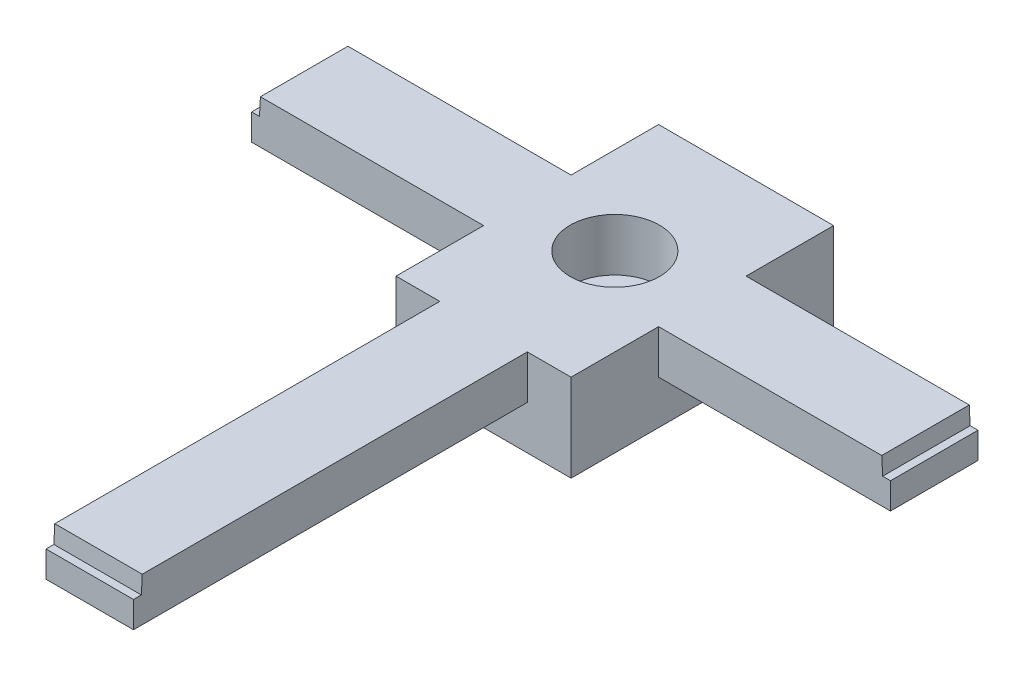
ISO-10303-21;
HEADER;
FILE_DESCRIPTION(('STEP AP214'),'2;1');
FILE_NAME('part.step','',(''),(''),'','','');
FILE_SCHEMA(('AUTOMOTIVE_DESIGN { 1 0 10303 214 1 1 1 1 }'));
ENDSEC;
DATA;
#1=APPLICATION_CONTEXT('core data for automotive mechanical design processes');
#2=APPLICATION_PROTOCOL_DEFINITION('international standard','automotive_design',2000,#1);
#3=PRODUCT_CONTEXT('',#1,'mechanical');
#4=PRODUCT('Part','Part','',(#3));
#5=PRODUCT_RELATED_PRODUCT_CATEGORY('part','',(#4));
#6=PRODUCT_DEFINITION_FORMATION('','',#4);
#7=PRODUCT_DEFINITION_CONTEXT('part definition',#1,'design');
#8=PRODUCT_DEFINITION('design','',#6,#7);
#9=PRODUCT_DEFINITION_SHAPE('','',#8);
#10=(LENGTH_UNIT() NAMED_UNIT(*) SI_UNIT(.MILLI.,.METRE.));
#11=(NAMED_UNIT(*) PLANE_ANGLE_UNIT() SI_UNIT($,.RADIAN.));
#12=(NAMED_UNIT(*) SI_UNIT($,.STERADIAN.) SOLID_ANGLE_UNIT());
#13=UNCERTAINTY_MEASURE_WITH_UNIT(LENGTH_MEASURE(1.E-05),#10,'distance_accuracy_value','');
#14=(GEOMETRIC_REPRESENTATION_CONTEXT(3) GLOBAL_UNCERTAINTY_ASSIGNED_CONTEXT((#13)) GLOBAL_UNIT_ASSIGNED_CONTEXT((#10,
#11,#12)) REPRESENTATION_CONTEXT('',''));
#15=CARTESIAN_POINT('',(0.,0.,0.));
#16=DIRECTION('',(0.,0.,1.));
#17=DIRECTION('',(1.,0.,0.));
#18=AXIS2_PLACEMENT_3D('',#15,#16,#17);
#19=CARTESIAN_POINT('',(0.,5.,0.));
#20=DIRECTION('',(0.,0.,1.));
#21=DIRECTION('',(1.,0.,0.));
#22=AXIS2_PLACEMENT_3D('',#19,#20,#21);
#23=PLANE('',#22);
#24=DIRECTION('',(-1.,0.,0.));
#25=VECTOR('',#24,1.);
#26=CARTESIAN_POINT('',(0.,0.,0.));
#27=LINE('',#26,#25);
#28=CARTESIAN_POINT('',(0.,0.,0.));
#29=VERTEX_POINT('',#28);
#30=CARTESIAN_POINT('',(-26.5,0.,0.));
#31=VERTEX_POINT('',#30);
#32=EDGE_CURVE('E310',#29,#31,#27,.T.);
#33=ORIENTED_EDGE('',*,*,#32,.T.);
#34=DIRECTION('',(0.,1.,0.));
#35=VECTOR('',#34,1.);
#36=CARTESIAN_POINT('',(-26.5,5.,0.));
#37=LINE('',#36,#35);
#38=CARTESIAN_POINT('',(-26.5,5.,0.));
#39=VERTEX_POINT('',#38);
#40=EDGE_CURVE('E62',#31,#39,#37,.T.);
#41=ORIENTED_EDGE('',*,*,#40,.T.);
#42=DIRECTION('',(-1.,0.,0.));
#43=VECTOR('',#42,1.);
#44=CARTESIAN_POINT('',(0.,5.,0.));
#45=LINE('',#44,#43);
#46=CARTESIAN_POINT('',(-1.,5.,0.));
#47=VERTEX_POINT('',#46);
#48=EDGE_CURVE('E295',#47,#39,#45,.T.);
#49=ORIENTED_EDGE('',*,*,#48,.F.);
#50=DIRECTION('',(0.0523359562429438,-0.998629534754574,0.));
#51=VECTOR('',#50,1.);
#52=CARTESIAN_POINT('',(-0.997260947684137,4.94773576836617,0.));
#53=LINE('',#52,#51);
#54=CARTESIAN_POINT('',(-0.895184441433918,3.,0.));
#55=VERTEX_POINT('',#54);
#56=EDGE_CURVE('E263',#47,#55,#53,.T.);
#57=ORIENTED_EDGE('',*,*,#56,.T.);
#58=DIRECTION('',(-1.,0.,0.));
#59=VECTOR('',#58,1.);
#60=CARTESIAN_POINT('',(0.,3.,0.));
#61=LINE('',#60,#59);
#62=CARTESIAN_POINT('',(0.,3.,0.));
#63=VERTEX_POINT('',#62);
#64=EDGE_CURVE('E261',#63,#55,#61,.T.);
#65=ORIENTED_EDGE('',*,*,#64,.F.);
#66=DIRECTION('',(0.,-1.,0.));
#67=VECTOR('',#66,1.);
#68=CARTESIAN_POINT('',(0.,5.,0.));
#69=LINE('',#68,#67);
#70=EDGE_CURVE('E291',#63,#29,#69,.T.);
#71=ORIENTED_EDGE('',*,*,#70,.T.);
#72=EDGE_LOOP('',(#33,#41,#49,#57,#65,#71));
#73=FACE_BOUND('',#72,.T.);
#74=ADVANCED_FACE('F38',(#73),#23,.F.);
#75=CARTESIAN_POINT('',(0.,0.,0.));
#76=DIRECTION('',(0.,-1.,0.));
#77=DIRECTION('',(0.,0.,-1.));
#78=AXIS2_PLACEMENT_3D('',#75,#76,#77);
#79=PLANE('',#78);
#80=DIRECTION('',(0.,0.,1.));
#81=VECTOR('',#80,1.);
#82=CARTESIAN_POINT('',(-26.5,0.,0.));
#83=LINE('',#82,#81);
#84=CARTESIAN_POINT('',(-26.5,0.,10.));
#85=VERTEX_POINT('',#84);
#86=EDGE_CURVE('E12',#31,#85,#83,.T.);
#87=ORIENTED_EDGE('',*,*,#86,.F.);
#88=ORIENTED_EDGE('',*,*,#32,.F.);
#89=DIRECTION('',(0.,0.,-1.));
#90=VECTOR('',#89,1.);
#91=CARTESIAN_POINT('',(0.,0.,0.));
#92=LINE('',#91,#90);
#93=CARTESIAN_POINT('',(0.,0.,10.));
#94=VERTEX_POINT('',#93);
#95=EDGE_CURVE('E312',#94,#29,#92,.T.);
#96=ORIENTED_EDGE('',*,*,#95,.F.);
#97=DIRECTION('',(1.,0.,0.));
#98=VECTOR('',#97,1.);
#99=CARTESIAN_POINT('',(0.,0.,10.));
#100=LINE('',#99,#98);
#101=EDGE_CURVE('E292',#85,#94,#100,.T.);
#102=ORIENTED_EDGE('',*,*,#101,.F.);
#103=EDGE_LOOP('',(#87,#88,#96,#102));
#104=FACE_BOUND('',#103,.T.);
#105=ADVANCED_FACE('F408',(#104),#79,.T.);
#106=DIRECTION('',(-1.,0.,0.));
#107=VECTOR('',#106,1.);
#108=CARTESIAN_POINT('',(0.,0.,20.));
#109=LINE('',#108,#107);
#110=CARTESIAN_POINT('',(-31.5,0.,20.));
#111=VERTEX_POINT('',#110);
#112=CARTESIAN_POINT('',(-41.5,0.,20.));
#113=VERTEX_POINT('',#112);
#114=EDGE_CURVE('E47',#111,#113,#109,.T.);
#115=ORIENTED_EDGE('',*,*,#114,.F.);
#116=DIRECTION('',(0.,0.,-1.));
#117=VECTOR('',#116,1.);
#118=CARTESIAN_POINT('',(-31.5,0.,10.));
#119=LINE('',#118,#117);
#120=CARTESIAN_POINT('',(-31.5,0.,65.0000000000001));
#121=VERTEX_POINT('',#120);
#122=EDGE_CURVE('E294',#121,#111,#119,.T.);
#123=ORIENTED_EDGE('',*,*,#122,.F.);
#124=DIRECTION('',(1.,0.,0.));
#125=VECTOR('',#124,1.);
#126=CARTESIAN_POINT('',(-41.5,0.,65.0000000000001));
#127=LINE('',#126,#125);
#128=CARTESIAN_POINT('',(-41.5,0.,65.0000000000001));
#129=VERTEX_POINT('',#128);
#130=EDGE_CURVE('E298',#129,#121,#127,.T.);
#131=ORIENTED_EDGE('',*,*,#130,.F.);
#132=DIRECTION('',(0.,0.,1.));
#133=VECTOR('',#132,1.);
#134=CARTESIAN_POINT('',(-41.5,0.,10.));
#135=LINE('',#134,#133);
#136=EDGE_CURVE('E301',#113,#129,#135,.T.);
#137=ORIENTED_EDGE('',*,*,#136,.F.);
#138=EDGE_LOOP('',(#115,#123,#131,#137));
#139=FACE_BOUND('',#138,.T.);
#140=ADVANCED_FACE('F368',(#139),#79,.T.);
#141=CARTESIAN_POINT('',(0.,5.,0.));
#142=DIRECTION('',(-1.,0.,0.));
#143=DIRECTION('',(0.,0.,1.));
#144=AXIS2_PLACEMENT_3D('',#141,#142,#143);
#145=PLANE('',#144);
#146=DIRECTION('',(0.,0.,-1.));
#147=VECTOR('',#146,1.);
#148=CARTESIAN_POINT('',(0.,3.,0.));
#149=LINE('',#148,#147);
#150=CARTESIAN_POINT('',(0.,3.,10.));
#151=VERTEX_POINT('',#150);
#152=EDGE_CURVE('E259',#151,#63,#149,.T.);
#153=ORIENTED_EDGE('',*,*,#152,.F.);
#154=DIRECTION('',(0.,-1.,0.));
#155=VECTOR('',#154,1.);
#156=CARTESIAN_POINT('',(0.,5.,10.));
#157=LINE('',#156,#155);
#158=EDGE_CURVE('E319',#151,#94,#157,.T.);
#159=ORIENTED_EDGE('',*,*,#158,.T.);
#160=ORIENTED_EDGE('',*,*,#95,.T.);
#161=ORIENTED_EDGE('',*,*,#70,.F.);
#162=EDGE_LOOP('',(#153,#159,#160,#161));
#163=FACE_BOUND('',#162,.T.);
#164=ADVANCED_FACE('F404',(#163),#145,.F.);
#165=CARTESIAN_POINT('',(-73.,5.,0.));
#166=DIRECTION('',(1.,0.,0.));
#167=DIRECTION('',(0.,0.,-1.));
#168=AXIS2_PLACEMENT_3D('',#165,#166,#167);
#169=PLANE('',#168);
#170=DIRECTION('',(0.,0.,1.));
#171=VECTOR('',#170,1.);
#172=CARTESIAN_POINT('',(-73.,3.,0.));
#173=LINE('',#172,#171);
#174=CARTESIAN_POINT('',(-73.,3.,0.));
#175=VERTEX_POINT('',#174);
#176=CARTESIAN_POINT('',(-73.,3.,10.));
#177=VERTEX_POINT('',#176);
#178=EDGE_CURVE('E272',#175,#177,#173,.T.);
#179=ORIENTED_EDGE('',*,*,#178,.F.);
#180=DIRECTION('',(0.,-1.,0.));
#181=VECTOR('',#180,1.);
#182=CARTESIAN_POINT('',(-73.,5.,0.));
#183=LINE('',#182,#181);
#184=CARTESIAN_POINT('',(-73.,0.,0.));
#185=VERTEX_POINT('',#184);
#186=EDGE_CURVE('E335',#175,#185,#183,.T.);
#187=ORIENTED_EDGE('',*,*,#186,.T.);
#188=DIRECTION('',(0.,0.,1.));
#189=VECTOR('',#188,1.);
#190=CARTESIAN_POINT('',(-73.,0.,0.));
#191=LINE('',#190,#189);
#192=CARTESIAN_POINT('',(-73.,0.,10.));
#193=VERTEX_POINT('',#192);
#194=EDGE_CURVE('E306',#185,#193,#191,.T.);
#195=ORIENTED_EDGE('',*,*,#194,.T.);
#196=DIRECTION('',(0.,-1.,0.));
#197=VECTOR('',#196,1.);
#198=CARTESIAN_POINT('',(-73.,5.,10.));
#199=LINE('',#198,#197);
#200=EDGE_CURVE('E332',#177,#193,#199,.T.);
#201=ORIENTED_EDGE('',*,*,#200,.F.);
#202=EDGE_LOOP('',(#179,#187,#195,#201));
#203=FACE_BOUND('',#202,.T.);
#204=ADVANCED_FACE('F454',(#203),#169,.F.);
#205=CARTESIAN_POINT('',(-41.5,5.,65.0000000000001));
#206=DIRECTION('',(0.,0.,-1.));
#207=DIRECTION('',(-1.,0.,0.));
#208=AXIS2_PLACEMENT_3D('',#205,#206,#207);
#209=PLANE('',#208);
#210=DIRECTION('',(1.,0.,0.));
#211=VECTOR('',#210,1.);
#212=CARTESIAN_POINT('',(-41.5,3.,65.0000000000001));
#213=LINE('',#212,#211);
#214=CARTESIAN_POINT('',(-41.5,3.,65.0000000000001));
#215=VERTEX_POINT('',#214);
#216=CARTESIAN_POINT('',(-31.5,3.,65.0000000000001));
#217=VERTEX_POINT('',#216);
#218=EDGE_CURVE('E284',#215,#217,#213,.T.);
#219=ORIENTED_EDGE('',*,*,#218,.F.);
#220=DIRECTION('',(0.,-1.,0.));
#221=VECTOR('',#220,1.);
#222=CARTESIAN_POINT('',(-41.5,5.,65.0000000000001));
#223=LINE('',#222,#221);
#224=EDGE_CURVE('E328',#215,#129,#223,.T.);
#225=ORIENTED_EDGE('',*,*,#224,.T.);
#226=ORIENTED_EDGE('',*,*,#130,.T.);
#227=DIRECTION('',(0.,-1.,0.));
#228=VECTOR('',#227,1.);
#229=CARTESIAN_POINT('',(-31.5,5.,65.0000000000001));
#230=LINE('',#229,#228);
#231=EDGE_CURVE('E331',#217,#121,#230,.T.);
#232=ORIENTED_EDGE('',*,*,#231,.F.);
#233=EDGE_LOOP('',(#219,#225,#226,#232));
#234=FACE_BOUND('',#233,.T.);
#235=ADVANCED_FACE('F377',(#234),#209,.F.);
#236=CARTESIAN_POINT('',(0.,5.,0.));
#237=DIRECTION('',(0.,1.,0.));
#238=DIRECTION('',(0.,0.,1.));
#239=AXIS2_PLACEMENT_3D('',#236,#237,#238);
#240=PLANE('',#239);
#241=CARTESIAN_POINT('',(-36.5,5.,5.00000000000002));
#242=DIRECTION('',(0.,1.,0.));
#243=DIRECTION('',(0.,0.,1.));
#244=AXIS2_PLACEMENT_3D('',#241,#242,#243);
#245=CIRCLE('',#244,5.1);
#246=CARTESIAN_POINT('',(-36.5,5.,10.1));
#247=VERTEX_POINT('',#246);
#248=EDGE_CURVE('E224',#247,#247,#245,.T.);
#249=ORIENTED_EDGE('',*,*,#248,.F.);
#250=EDGE_LOOP('',(#249));
#251=FACE_BOUND('',#250,.T.);
#252=DIRECTION('',(1.,0.,0.));
#253=VECTOR('',#252,1.);
#254=CARTESIAN_POINT('',(-41.5,5.,10.));
#255=LINE('',#254,#253);
#256=CARTESIAN_POINT('',(-72.,5.,10.));
#257=VERTEX_POINT('',#256);
#258=CARTESIAN_POINT('',(-46.5,5.,10.));
#259=VERTEX_POINT('',#258);
#260=EDGE_CURVE('E324',#257,#259,#255,.T.);
#261=ORIENTED_EDGE('',*,*,#260,.T.);
#262=DIRECTION('',(0.,0.,1.));
#263=VECTOR('',#262,1.);
#264=CARTESIAN_POINT('',(-46.5,5.,-9.99999999999999));
#265=LINE('',#264,#263);
#266=CARTESIAN_POINT('',(-46.5,5.,20.));
#267=VERTEX_POINT('',#266);
#268=EDGE_CURVE('E234',#259,#267,#265,.T.);
#269=ORIENTED_EDGE('',*,*,#268,.T.);
#270=DIRECTION('',(1.,0.,0.));
#271=VECTOR('',#270,1.);
#272=CARTESIAN_POINT('',(-26.5,5.,20.));
#273=LINE('',#272,#271);
#274=CARTESIAN_POINT('',(-41.5,5.,20.));
#275=VERTEX_POINT('',#274);
#276=EDGE_CURVE('E218',#267,#275,#273,.T.);
#277=ORIENTED_EDGE('',*,*,#276,.T.);
#278=DIRECTION('',(0.,0.,1.));
#279=VECTOR('',#278,1.);
#280=CARTESIAN_POINT('',(-41.5,5.,10.));
#281=LINE('',#280,#279);
#282=CARTESIAN_POINT('',(-41.5,5.,64.0000000000001));
#283=VERTEX_POINT('',#282);
#284=EDGE_CURVE('E322',#275,#283,#281,.T.);
#285=ORIENTED_EDGE('',*,*,#284,.T.);
#286=DIRECTION('',(-1.,0.,0.));
#287=VECTOR('',#286,1.);
#288=CARTESIAN_POINT('',(0.,5.,64.0000000000001));
#289=LINE('',#288,#287);
#290=CARTESIAN_POINT('',(-31.5,5.,64.0000000000001));
#291=VERTEX_POINT('',#290);
#292=EDGE_CURVE('E278',#291,#283,#289,.T.);
#293=ORIENTED_EDGE('',*,*,#292,.F.);
#294=DIRECTION('',(0.,0.,-1.));
#295=VECTOR('',#294,1.);
#296=CARTESIAN_POINT('',(-31.5,5.,10.));
#297=LINE('',#296,#295);
#298=CARTESIAN_POINT('',(-31.5,5.,20.));
#299=VERTEX_POINT('',#298);
#300=EDGE_CURVE('E318',#291,#299,#297,.T.);
#301=ORIENTED_EDGE('',*,*,#300,.T.);
#302=CARTESIAN_POINT('',(-26.5,5.,20.));
#303=VERTEX_POINT('',#302);
#304=EDGE_CURVE('E221',#299,#303,#273,.T.);
#305=ORIENTED_EDGE('',*,*,#304,.T.);
#306=DIRECTION('',(0.,0.,-1.));
#307=VECTOR('',#306,1.);
#308=CARTESIAN_POINT('',(-26.5,5.,-9.99999999999999));
#309=LINE('',#308,#307);
#310=CARTESIAN_POINT('',(-26.5,5.,10.));
#311=VERTEX_POINT('',#310);
#312=EDGE_CURVE('E229',#303,#311,#309,.T.);
#313=ORIENTED_EDGE('',*,*,#312,.T.);
#314=DIRECTION('',(1.,0.,0.));
#315=VECTOR('',#314,1.);
#316=CARTESIAN_POINT('',(0.,5.,10.));
#317=LINE('',#316,#315);
#318=CARTESIAN_POINT('',(-0.999999999999999,5.,10.));
#319=VERTEX_POINT('',#318);
#320=EDGE_CURVE('E316',#311,#319,#317,.T.);
#321=ORIENTED_EDGE('',*,*,#320,.T.);
#322=DIRECTION('',(0.,0.,1.));
#323=VECTOR('',#322,1.);
#324=CARTESIAN_POINT('',(-1.,5.,0.));
#325=LINE('',#324,#323);
#326=EDGE_CURVE('E254',#47,#319,#325,.T.);
#327=ORIENTED_EDGE('',*,*,#326,.F.);
#328=ORIENTED_EDGE('',*,*,#48,.T.);
#329=CARTESIAN_POINT('',(-26.5,5.,-9.99999999999999));
#330=VERTEX_POINT('',#329);
#331=EDGE_CURVE('E232',#39,#330,#309,.T.);
#332=ORIENTED_EDGE('',*,*,#331,.T.);
#333=DIRECTION('',(-1.,0.,0.));
#334=VECTOR('',#333,1.);
#335=CARTESIAN_POINT('',(-26.5,5.,-9.99999999999999));
#336=LINE('',#335,#334);
#337=CARTESIAN_POINT('',(-46.5,5.,-9.99999999999999));
#338=VERTEX_POINT('',#337);
#339=EDGE_CURVE('E197',#330,#338,#336,.T.);
#340=ORIENTED_EDGE('',*,*,#339,.T.);
#341=CARTESIAN_POINT('',(-46.5,5.,0.));
#342=VERTEX_POINT('',#341);
#343=EDGE_CURVE('E235',#338,#342,#265,.T.);
#344=ORIENTED_EDGE('',*,*,#343,.T.);
#345=CARTESIAN_POINT('',(-72.,5.,0.));
#346=VERTEX_POINT('',#345);
#347=EDGE_CURVE('E54',#342,#346,#45,.T.);
#348=ORIENTED_EDGE('',*,*,#347,.T.);
#349=DIRECTION('',(0.,0.,-1.));
#350=VECTOR('',#349,1.);
#351=CARTESIAN_POINT('',(-72.,5.,0.));
#352=LINE('',#351,#350);
#353=EDGE_CURVE('E266',#257,#346,#352,.T.);
#354=ORIENTED_EDGE('',*,*,#353,.F.);
#355=EDGE_LOOP('',(#261,#269,#277,#285,#293,#301,#305,#313,#321,#327,#328,#332,#340,#344,#348,#354));
#356=FACE_BOUND('',#355,.T.);
#357=ADVANCED_FACE('F384',(#251,#356),#240,.T.);
#358=ORIENTED_EDGE('',*,*,#347,.F.);
#359=DIRECTION('',(0.,-1.,0.));
#360=VECTOR('',#359,1.);
#361=CARTESIAN_POINT('',(-46.5,5.,0.));
#362=LINE('',#361,#360);
#363=CARTESIAN_POINT('',(-46.5,0.,0.));
#364=VERTEX_POINT('',#363);
#365=EDGE_CURVE('E245',#342,#364,#362,.T.);
#366=ORIENTED_EDGE('',*,*,#365,.T.);
#367=EDGE_CURVE('E309',#364,#185,#27,.T.);
#368=ORIENTED_EDGE('',*,*,#367,.T.);
#369=ORIENTED_EDGE('',*,*,#186,.F.);
#370=DIRECTION('',(-1.,0.,0.));
#371=VECTOR('',#370,1.);
#372=CARTESIAN_POINT('',(0.,3.,0.));
#373=LINE('',#372,#371);
#374=CARTESIAN_POINT('',(-72.1048155585661,3.,0.));
#375=VERTEX_POINT('',#374);
#376=EDGE_CURVE('E274',#375,#175,#373,.T.);
#377=ORIENTED_EDGE('',*,*,#376,.F.);
#378=DIRECTION('',(0.0523359562429438,0.998629534754574,0.));
#379=VECTOR('',#378,1.);
#380=CARTESIAN_POINT('',(-71.8027882332578,8.76302467763552,0.));
#381=LINE('',#380,#379);
#382=EDGE_CURVE('E276',#375,#346,#381,.T.);
#383=ORIENTED_EDGE('',*,*,#382,.T.);
#384=EDGE_LOOP('',(#358,#366,#368,#369,#377,#383));
#385=FACE_BOUND('',#384,.T.);
#386=ADVANCED_FACE('F40',(#385),#23,.F.);
#387=CARTESIAN_POINT('',(-41.5,5.,10.));
#388=DIRECTION('',(0.,0.,-1.));
#389=DIRECTION('',(-1.,0.,0.));
#390=AXIS2_PLACEMENT_3D('',#387,#388,#389);
#391=PLANE('',#390);
#392=DIRECTION('',(1.,0.,0.));
#393=VECTOR('',#392,1.);
#394=CARTESIAN_POINT('',(-41.5,0.,10.));
#395=LINE('',#394,#393);
#396=CARTESIAN_POINT('',(-46.5,0.,10.));
#397=VERTEX_POINT('',#396);
#398=EDGE_CURVE('E303',#193,#397,#395,.T.);
#399=ORIENTED_EDGE('',*,*,#398,.T.);
#400=DIRECTION('',(0.,1.,0.));
#401=VECTOR('',#400,1.);
#402=CARTESIAN_POINT('',(-46.5,5.,10.));
#403=LINE('',#402,#401);
#404=EDGE_CURVE('E239',#397,#259,#403,.T.);
#405=ORIENTED_EDGE('',*,*,#404,.T.);
#406=ORIENTED_EDGE('',*,*,#260,.F.);
#407=DIRECTION('',(-0.0523359562429438,-0.998629534754574,0.));
#408=VECTOR('',#407,1.);
#409=CARTESIAN_POINT('',(-71.9164589043662,6.59405906483171,10.));
#410=LINE('',#409,#408);
#411=CARTESIAN_POINT('',(-72.1048155585661,3.,10.));
#412=VERTEX_POINT('',#411);
#413=EDGE_CURVE('E347',#257,#412,#410,.T.);
#414=ORIENTED_EDGE('',*,*,#413,.T.);
#415=DIRECTION('',(1.,0.,0.));
#416=VECTOR('',#415,1.);
#417=CARTESIAN_POINT('',(-41.5,3.,10.));
#418=LINE('',#417,#416);
#419=EDGE_CURVE('E345',#177,#412,#418,.T.);
#420=ORIENTED_EDGE('',*,*,#419,.F.);
#421=ORIENTED_EDGE('',*,*,#200,.T.);
#422=EDGE_LOOP('',(#399,#405,#406,#414,#420,#421));
#423=FACE_BOUND('',#422,.T.);
#424=ADVANCED_FACE('F444',(#423),#391,.F.);
#425=CARTESIAN_POINT('',(-41.5,5.,10.));
#426=DIRECTION('',(1.,0.,0.));
#427=DIRECTION('',(0.,0.,-1.));
#428=AXIS2_PLACEMENT_3D('',#425,#426,#427);
#429=PLANE('',#428);
#430=ORIENTED_EDGE('',*,*,#284,.F.);
#431=DIRECTION('',(0.,-1.,0.));
#432=VECTOR('',#431,1.);
#433=CARTESIAN_POINT('',(-41.5,5.,20.));
#434=LINE('',#433,#432);
#435=EDGE_CURVE('E249',#275,#113,#434,.T.);
#436=ORIENTED_EDGE('',*,*,#435,.T.);
#437=ORIENTED_EDGE('',*,*,#136,.T.);
#438=ORIENTED_EDGE('',*,*,#224,.F.);
#439=DIRECTION('',(0.,0.,1.));
#440=VECTOR('',#439,1.);
#441=CARTESIAN_POINT('',(-41.5,3.,10.));
#442=LINE('',#441,#440);
#443=CARTESIAN_POINT('',(-41.5,3.,64.1048155585661));
#444=VERTEX_POINT('',#443);
#445=EDGE_CURVE('E286',#444,#215,#442,.T.);
#446=ORIENTED_EDGE('',*,*,#445,.F.);
#447=DIRECTION('',(0.,0.998629534754574,-0.0523359562429438));
#448=VECTOR('',#447,1.);
#449=CARTESIAN_POINT('',(-41.5,7.82226850822664,63.8520911749434));
#450=LINE('',#449,#448);
#451=EDGE_CURVE('E288',#444,#283,#450,.T.);
#452=ORIENTED_EDGE('',*,*,#451,.T.);
#453=EDGE_LOOP('',(#430,#436,#437,#438,#446,#452));
#454=FACE_BOUND('',#453,.T.);
#455=ADVANCED_FACE('F381',(#454),#429,.F.);
#456=CARTESIAN_POINT('',(-31.5,5.,10.));
#457=DIRECTION('',(-1.,0.,0.));
#458=DIRECTION('',(0.,0.,1.));
#459=AXIS2_PLACEMENT_3D('',#456,#457,#458);
#460=PLANE('',#459);
#461=ORIENTED_EDGE('',*,*,#122,.T.);
#462=DIRECTION('',(0.,1.,0.));
#463=VECTOR('',#462,1.);
#464=CARTESIAN_POINT('',(-31.5,5.,20.));
#465=LINE('',#464,#463);
#466=EDGE_CURVE('E247',#111,#299,#465,.T.);
#467=ORIENTED_EDGE('',*,*,#466,.T.);
#468=ORIENTED_EDGE('',*,*,#300,.F.);
#469=DIRECTION('',(0.,-0.998629534754574,0.0523359562429438));
#470=VECTOR('',#469,1.);
#471=CARTESIAN_POINT('',(-31.5,7.82226850822664,63.8520911749434));
#472=LINE('',#471,#470);
#473=CARTESIAN_POINT('',(-31.5,3.,64.1048155585661));
#474=VERTEX_POINT('',#473);
#475=EDGE_CURVE('E342',#291,#474,#472,.T.);
#476=ORIENTED_EDGE('',*,*,#475,.T.);
#477=DIRECTION('',(0.,0.,-1.));
#478=VECTOR('',#477,1.);
#479=CARTESIAN_POINT('',(-31.5,3.,10.));
#480=LINE('',#479,#478);
#481=EDGE_CURVE('E315',#217,#474,#480,.T.);
#482=ORIENTED_EDGE('',*,*,#481,.F.);
#483=ORIENTED_EDGE('',*,*,#231,.T.);
#484=EDGE_LOOP('',(#461,#467,#468,#476,#482,#483));
#485=FACE_BOUND('',#484,.T.);
#486=ADVANCED_FACE('F371',(#485),#460,.F.);
#487=CARTESIAN_POINT('',(0.,5.,10.));
#488=DIRECTION('',(0.,0.,-1.));
#489=DIRECTION('',(-1.,0.,0.));
#490=AXIS2_PLACEMENT_3D('',#487,#488,#489);
#491=PLANE('',#490);
#492=ORIENTED_EDGE('',*,*,#320,.F.);
#493=DIRECTION('',(0.,-1.,0.));
#494=VECTOR('',#493,1.);
#495=CARTESIAN_POINT('',(-26.5,5.,10.));
#496=LINE('',#495,#494);
#497=EDGE_CURVE('E251',#311,#85,#496,.T.);
#498=ORIENTED_EDGE('',*,*,#497,.T.);
#499=ORIENTED_EDGE('',*,*,#101,.T.);
#500=ORIENTED_EDGE('',*,*,#158,.F.);
#501=DIRECTION('',(1.,0.,0.));
#502=VECTOR('',#501,1.);
#503=CARTESIAN_POINT('',(0.,3.,10.));
#504=LINE('',#503,#502);
#505=CARTESIAN_POINT('',(-0.895184441433918,3.,10.));
#506=VERTEX_POINT('',#505);
#507=EDGE_CURVE('E350',#506,#151,#504,.T.);
#508=ORIENTED_EDGE('',*,*,#507,.F.);
#509=DIRECTION('',(-0.0523359562429438,0.998629534754574,0.));
#510=VECTOR('',#509,1.);
#511=CARTESIAN_POINT('',(-0.997260947684135,4.94773576836617,10.));
#512=LINE('',#511,#510);
#513=EDGE_CURVE('E352',#506,#319,#512,.T.);
#514=ORIENTED_EDGE('',*,*,#513,.T.);
#515=EDGE_LOOP('',(#492,#498,#499,#500,#508,#514));
#516=FACE_BOUND('',#515,.T.);
#517=ADVANCED_FACE('F396',(#516),#491,.F.);
#518=DIRECTION('',(0.,0.,-1.));
#519=VECTOR('',#518,1.);
#520=CARTESIAN_POINT('',(-46.5,0.,0.));
#521=LINE('',#520,#519);
#522=EDGE_CURVE('E355',#397,#364,#521,.T.);
#523=ORIENTED_EDGE('',*,*,#522,.F.);
#524=ORIENTED_EDGE('',*,*,#398,.F.);
#525=ORIENTED_EDGE('',*,*,#194,.F.);
#526=ORIENTED_EDGE('',*,*,#367,.F.);
#527=EDGE_LOOP('',(#523,#524,#525,#526));
#528=FACE_BOUND('',#527,.T.);
#529=ADVANCED_FACE('F442',(#528),#79,.T.);
#530=CARTESIAN_POINT('',(0.,5.,64.0000000000001));
#531=DIRECTION('',(0.,-0.0523359562429438,-0.998629534754574));
#532=DIRECTION('',(0.,0.998629534754574,-0.0523359562429438));
#533=AXIS2_PLACEMENT_3D('',#530,#531,#532);
#534=PLANE('',#533);
#535=DIRECTION('',(-1.,0.,0.));
#536=VECTOR('',#535,1.);
#537=CARTESIAN_POINT('',(0.,3.,64.1048155585661));
#538=LINE('',#537,#536);
#539=EDGE_CURVE('E281',#474,#444,#538,.T.);
#540=ORIENTED_EDGE('',*,*,#539,.F.);
#541=ORIENTED_EDGE('',*,*,#475,.F.);
#542=ORIENTED_EDGE('',*,*,#292,.T.);
#543=ORIENTED_EDGE('',*,*,#451,.F.);
#544=EDGE_LOOP('',(#540,#541,#542,#543));
#545=FACE_BOUND('',#544,.T.);
#546=ADVANCED_FACE('F387',(#545),#534,.F.);
#547=CARTESIAN_POINT('',(0.,3.,0.));
#548=DIRECTION('',(0.,1.,0.));
#549=DIRECTION('',(0.,0.,1.));
#550=AXIS2_PLACEMENT_3D('',#547,#548,#549);
#551=PLANE('',#550);
#552=ORIENTED_EDGE('',*,*,#445,.T.);
#553=ORIENTED_EDGE('',*,*,#218,.T.);
#554=ORIENTED_EDGE('',*,*,#481,.T.);
#555=ORIENTED_EDGE('',*,*,#539,.T.);
#556=EDGE_LOOP('',(#552,#553,#554,#555));
#557=FACE_BOUND('',#556,.T.);
#558=ADVANCED_FACE('F476',(#557),#551,.T.);
#559=CARTESIAN_POINT('',(-72.,5.,0.));
#560=DIRECTION('',(0.998629534754574,-0.0523359562429438,0.));
#561=DIRECTION('',(0.0523359562429438,0.998629534754574,0.));
#562=AXIS2_PLACEMENT_3D('',#559,#560,#561);
#563=PLANE('',#562);
#564=DIRECTION('',(0.,0.,-1.));
#565=VECTOR('',#564,1.);
#566=CARTESIAN_POINT('',(-72.1048155585661,3.,0.));
#567=LINE('',#566,#565);
#568=EDGE_CURVE('E269',#412,#375,#567,.T.);
#569=ORIENTED_EDGE('',*,*,#568,.F.);
#570=ORIENTED_EDGE('',*,*,#413,.F.);
#571=ORIENTED_EDGE('',*,*,#353,.T.);
#572=ORIENTED_EDGE('',*,*,#382,.F.);
#573=EDGE_LOOP('',(#569,#570,#571,#572));
#574=FACE_BOUND('',#573,.T.);
#575=ADVANCED_FACE('F591',(#574),#563,.F.);
#576=CARTESIAN_POINT('',(0.,3.,0.));
#577=DIRECTION('',(0.,1.,0.));
#578=DIRECTION('',(0.,0.,1.));
#579=AXIS2_PLACEMENT_3D('',#576,#577,#578);
#580=PLANE('',#579);
#581=ORIENTED_EDGE('',*,*,#376,.T.);
#582=ORIENTED_EDGE('',*,*,#178,.T.);
#583=ORIENTED_EDGE('',*,*,#419,.T.);
#584=ORIENTED_EDGE('',*,*,#568,.T.);
#585=EDGE_LOOP('',(#581,#582,#583,#584));
#586=FACE_BOUND('',#585,.T.);
#587=ADVANCED_FACE('F607',(#586),#580,.T.);
#588=CARTESIAN_POINT('',(-1.,5.,0.));
#589=DIRECTION('',(-0.998629534754574,-0.0523359562429438,0.));
#590=DIRECTION('',(0.0523359562429438,-0.998629534754574,0.));
#591=AXIS2_PLACEMENT_3D('',#588,#589,#590);
#592=PLANE('',#591);
#593=ORIENTED_EDGE('',*,*,#326,.T.);
#594=ORIENTED_EDGE('',*,*,#513,.F.);
#595=DIRECTION('',(0.,0.,1.));
#596=VECTOR('',#595,1.);
#597=CARTESIAN_POINT('',(-0.895184441433918,3.,0.));
#598=LINE('',#597,#596);
#599=EDGE_CURVE('E257',#55,#506,#598,.T.);
#600=ORIENTED_EDGE('',*,*,#599,.F.);
#601=ORIENTED_EDGE('',*,*,#56,.F.);
#602=EDGE_LOOP('',(#593,#594,#600,#601));
#603=FACE_BOUND('',#602,.T.);
#604=ADVANCED_FACE('F393',(#603),#592,.F.);
#605=CARTESIAN_POINT('',(0.,3.,0.));
#606=DIRECTION('',(0.,1.,0.));
#607=DIRECTION('',(0.,0.,1.));
#608=AXIS2_PLACEMENT_3D('',#605,#606,#607);
#609=PLANE('',#608);
#610=ORIENTED_EDGE('',*,*,#64,.T.);
#611=ORIENTED_EDGE('',*,*,#599,.T.);
#612=ORIENTED_EDGE('',*,*,#507,.T.);
#613=ORIENTED_EDGE('',*,*,#152,.T.);
#614=EDGE_LOOP('',(#610,#611,#612,#613));
#615=FACE_BOUND('',#614,.T.);
#616=ADVANCED_FACE('F400',(#615),#609,.T.);
#617=CARTESIAN_POINT('',(-26.5,-5.,-9.99999999999999));
#618=DIRECTION('',(1.,0.,0.));
#619=DIRECTION('',(0.,0.,-1.));
#620=AXIS2_PLACEMENT_3D('',#617,#618,#619);
#621=PLANE('',#620);
#622=ORIENTED_EDGE('',*,*,#40,.F.);
#623=ORIENTED_EDGE('',*,*,#86,.T.);
#624=ORIENTED_EDGE('',*,*,#497,.F.);
#625=ORIENTED_EDGE('',*,*,#312,.F.);
#626=DIRECTION('',(0.,1.,0.));
#627=VECTOR('',#626,1.);
#628=CARTESIAN_POINT('',(-26.5,-5.,20.));
#629=LINE('',#628,#627);
#630=CARTESIAN_POINT('',(-26.5,-5.,20.));
#631=VERTEX_POINT('',#630);
#632=EDGE_CURVE('E217',#631,#303,#629,.T.);
#633=ORIENTED_EDGE('',*,*,#632,.F.);
#634=DIRECTION('',(0.,0.,-1.));
#635=VECTOR('',#634,1.);
#636=CARTESIAN_POINT('',(-26.5,-5.,-9.99999999999999));
#637=LINE('',#636,#635);
#638=CARTESIAN_POINT('',(-26.5,-5.,-9.99999999999999));
#639=VERTEX_POINT('',#638);
#640=EDGE_CURVE('E209',#631,#639,#637,.T.);
#641=ORIENTED_EDGE('',*,*,#640,.T.);
#642=DIRECTION('',(0.,1.,0.));
#643=VECTOR('',#642,1.);
#644=CARTESIAN_POINT('',(-26.5,-5.,-9.99999999999999));
#645=LINE('',#644,#643);
#646=EDGE_CURVE('E192',#639,#330,#645,.T.);
#647=ORIENTED_EDGE('',*,*,#646,.T.);
#648=ORIENTED_EDGE('',*,*,#331,.F.);
#649=EDGE_LOOP('',(#622,#623,#624,#625,#633,#641,#647,#648));
#650=FACE_BOUND('',#649,.T.);
#651=ADVANCED_FACE('F214',(#650),#621,.T.);
#652=CARTESIAN_POINT('',(-26.5,-5.,20.));
#653=DIRECTION('',(0.,0.,1.));
#654=DIRECTION('',(1.,0.,0.));
#655=AXIS2_PLACEMENT_3D('',#652,#653,#654);
#656=PLANE('',#655);
#657=ORIENTED_EDGE('',*,*,#435,.F.);
#658=ORIENTED_EDGE('',*,*,#276,.F.);
#659=DIRECTION('',(0.,1.,0.));
#660=VECTOR('',#659,1.);
#661=CARTESIAN_POINT('',(-46.5,-5.,20.));
#662=LINE('',#661,#660);
#663=CARTESIAN_POINT('',(-46.5,-5.,20.));
#664=VERTEX_POINT('',#663);
#665=EDGE_CURVE('E240',#664,#267,#662,.T.);
#666=ORIENTED_EDGE('',*,*,#665,.F.);
#667=DIRECTION('',(1.,0.,0.));
#668=VECTOR('',#667,1.);
#669=CARTESIAN_POINT('',(-26.5,-5.,20.));
#670=LINE('',#669,#668);
#671=EDGE_CURVE('E202',#664,#631,#670,.T.);
#672=ORIENTED_EDGE('',*,*,#671,.T.);
#673=ORIENTED_EDGE('',*,*,#632,.T.);
#674=ORIENTED_EDGE('',*,*,#304,.F.);
#675=ORIENTED_EDGE('',*,*,#466,.F.);
#676=ORIENTED_EDGE('',*,*,#114,.T.);
#677=EDGE_LOOP('',(#657,#658,#666,#672,#673,#674,#675,#676));
#678=FACE_BOUND('',#677,.T.);
#679=ADVANCED_FACE('F362',(#678),#656,.T.);
#680=CARTESIAN_POINT('',(-46.5,-5.,-9.99999999999999));
#681=DIRECTION('',(-1.,0.,0.));
#682=DIRECTION('',(0.,0.,1.));
#683=AXIS2_PLACEMENT_3D('',#680,#681,#682);
#684=PLANE('',#683);
#685=ORIENTED_EDGE('',*,*,#365,.F.);
#686=ORIENTED_EDGE('',*,*,#343,.F.);
#687=DIRECTION('',(0.,1.,0.));
#688=VECTOR('',#687,1.);
#689=CARTESIAN_POINT('',(-46.5,-5.,-9.99999999999999));
#690=LINE('',#689,#688);
#691=CARTESIAN_POINT('',(-46.5,-5.,-9.99999999999999));
#692=VERTEX_POINT('',#691);
#693=EDGE_CURVE('E201',#692,#338,#690,.T.);
#694=ORIENTED_EDGE('',*,*,#693,.F.);
#695=DIRECTION('',(0.,0.,1.));
#696=VECTOR('',#695,1.);
#697=CARTESIAN_POINT('',(-46.5,-5.,-9.99999999999999));
#698=LINE('',#697,#696);
#699=EDGE_CURVE('E212',#692,#664,#698,.T.);
#700=ORIENTED_EDGE('',*,*,#699,.T.);
#701=ORIENTED_EDGE('',*,*,#665,.T.);
#702=ORIENTED_EDGE('',*,*,#268,.F.);
#703=ORIENTED_EDGE('',*,*,#404,.F.);
#704=ORIENTED_EDGE('',*,*,#522,.T.);
#705=EDGE_LOOP('',(#685,#686,#694,#700,#701,#702,#703,#704));
#706=FACE_BOUND('',#705,.T.);
#707=ADVANCED_FACE('F675',(#706),#684,.T.);
#708=CARTESIAN_POINT('',(-26.5,-5.,-9.99999999999999));
#709=DIRECTION('',(0.,0.,-1.));
#710=DIRECTION('',(-1.,0.,0.));
#711=AXIS2_PLACEMENT_3D('',#708,#709,#710);
#712=PLANE('',#711);
#713=ORIENTED_EDGE('',*,*,#339,.F.);
#714=ORIENTED_EDGE('',*,*,#646,.F.);
#715=DIRECTION('',(-1.,0.,0.));
#716=VECTOR('',#715,1.);
#717=CARTESIAN_POINT('',(-26.5,-5.,-9.99999999999999));
#718=LINE('',#717,#716);
#719=EDGE_CURVE('E195',#639,#692,#718,.T.);
#720=ORIENTED_EDGE('',*,*,#719,.T.);
#721=ORIENTED_EDGE('',*,*,#693,.T.);
#722=EDGE_LOOP('',(#713,#714,#720,#721));
#723=FACE_BOUND('',#722,.T.);
#724=ADVANCED_FACE('F194',(#723),#712,.T.);
#725=CARTESIAN_POINT('',(0.,-5.,0.));
#726=DIRECTION('',(0.,-1.,0.));
#727=DIRECTION('',(0.,0.,-1.));
#728=AXIS2_PLACEMENT_3D('',#725,#726,#727);
#729=PLANE('',#728);
#730=CARTESIAN_POINT('',(-36.5,-5.,5.));
#731=DIRECTION('',(0.,1.,0.));
#732=DIRECTION('',(0.,0.,1.));
#733=AXIS2_PLACEMENT_3D('',#730,#731,#732);
#734=CIRCLE('',#733,3.);
#735=CARTESIAN_POINT('',(-36.5,-5.,8.));
#736=VERTEX_POINT('',#735);
#737=EDGE_CURVE('E416',#736,#736,#734,.T.);
#738=ORIENTED_EDGE('',*,*,#737,.T.);
#739=EDGE_LOOP('',(#738));
#740=FACE_BOUND('',#739,.T.);
#741=ORIENTED_EDGE('',*,*,#640,.F.);
#742=ORIENTED_EDGE('',*,*,#671,.F.);
#743=ORIENTED_EDGE('',*,*,#699,.F.);
#744=ORIENTED_EDGE('',*,*,#719,.F.);
#745=EDGE_LOOP('',(#741,#742,#743,#744));
#746=FACE_BOUND('',#745,.T.);
#747=ADVANCED_FACE('F207',(#740,#746),#729,.T.);
#748=CARTESIAN_POINT('',(-36.5,-1.,5.00000000000002));
#749=DIRECTION('',(0.,1.,0.));
#750=DIRECTION('',(0.,0.,1.));
#751=AXIS2_PLACEMENT_3D('',#748,#749,#750);
#752=CYLINDRICAL_SURFACE('',#751,5.1);
#753=CARTESIAN_POINT('',(-36.5,-1.,5.00000000000002));
#754=DIRECTION('',(0.,1.,0.));
#755=DIRECTION('',(0.,0.,1.));
#756=AXIS2_PLACEMENT_3D('',#753,#754,#755);
#757=CIRCLE('',#756,5.1);
#758=CARTESIAN_POINT('',(-36.5,-1.,10.1));
#759=VERTEX_POINT('',#758);
#760=EDGE_CURVE('E410',#759,#759,#757,.T.);
#761=ORIENTED_EDGE('',*,*,#760,.F.);
#762=EDGE_LOOP('',(#761));
#763=FACE_BOUND('',#762,.T.);
#764=ORIENTED_EDGE('',*,*,#248,.T.);
#765=EDGE_LOOP('',(#764));
#766=FACE_BOUND('',#765,.T.);
#767=ADVANCED_FACE('F428',(#763,#766),#752,.F.);
#768=CARTESIAN_POINT('',(-36.5,-1.,5.00000000000002));
#769=DIRECTION('',(0.,1.,0.));
#770=DIRECTION('',(0.,0.,1.));
#771=AXIS2_PLACEMENT_3D('',#768,#769,#770);
#772=PLANE('',#771);
#773=CARTESIAN_POINT('',(-36.5,-1.,5.));
#774=DIRECTION('',(0.,1.,0.));
#775=DIRECTION('',(0.,0.,1.));
#776=AXIS2_PLACEMENT_3D('',#773,#774,#775);
#777=CIRCLE('',#776,3.);
#778=CARTESIAN_POINT('',(-36.5,-1.,8.));
#779=VERTEX_POINT('',#778);
#780=EDGE_CURVE('E42',#779,#779,#777,.T.);
#781=ORIENTED_EDGE('',*,*,#780,.F.);
#782=EDGE_LOOP('',(#781));
#783=FACE_BOUND('',#782,.T.);
#784=ORIENTED_EDGE('',*,*,#760,.T.);
#785=EDGE_LOOP('',(#784));
#786=FACE_BOUND('',#785,.T.);
#787=ADVANCED_FACE('F426',(#783,#786),#772,.T.);
#788=CARTESIAN_POINT('',(-36.5,-5.,5.));
#789=DIRECTION('',(0.,1.,0.));
#790=DIRECTION('',(0.,0.,1.));
#791=AXIS2_PLACEMENT_3D('',#788,#789,#790);
#792=CYLINDRICAL_SURFACE('',#791,3.);
#793=ORIENTED_EDGE('',*,*,#780,.T.);
#794=EDGE_LOOP('',(#793));
#795=FACE_BOUND('',#794,.T.);
#796=ORIENTED_EDGE('',*,*,#737,.F.);
#797=EDGE_LOOP('',(#796));
#798=FACE_BOUND('',#797,.T.);
#799=ADVANCED_FACE('F423',(#795,#798),#792,.F.);
#800=CLOSED_SHELL('',(#74,#105,#140,#164,#204,#235,#357,#386,#424,#455,#486,#517,#529,#546,#558,
#575,#587,#604,#616,#651,#679,#707,#724,#747,#767,#787,#799));
#801=MANIFOLD_SOLID_BREP('B2',#800);
#802=ADVANCED_BREP_SHAPE_REPRESENTATION('',(#18,#801),#14);
#803=SHAPE_DEFINITION_REPRESENTATION(#9,#802);
ENDSEC;
END-ISO-10303-21;
